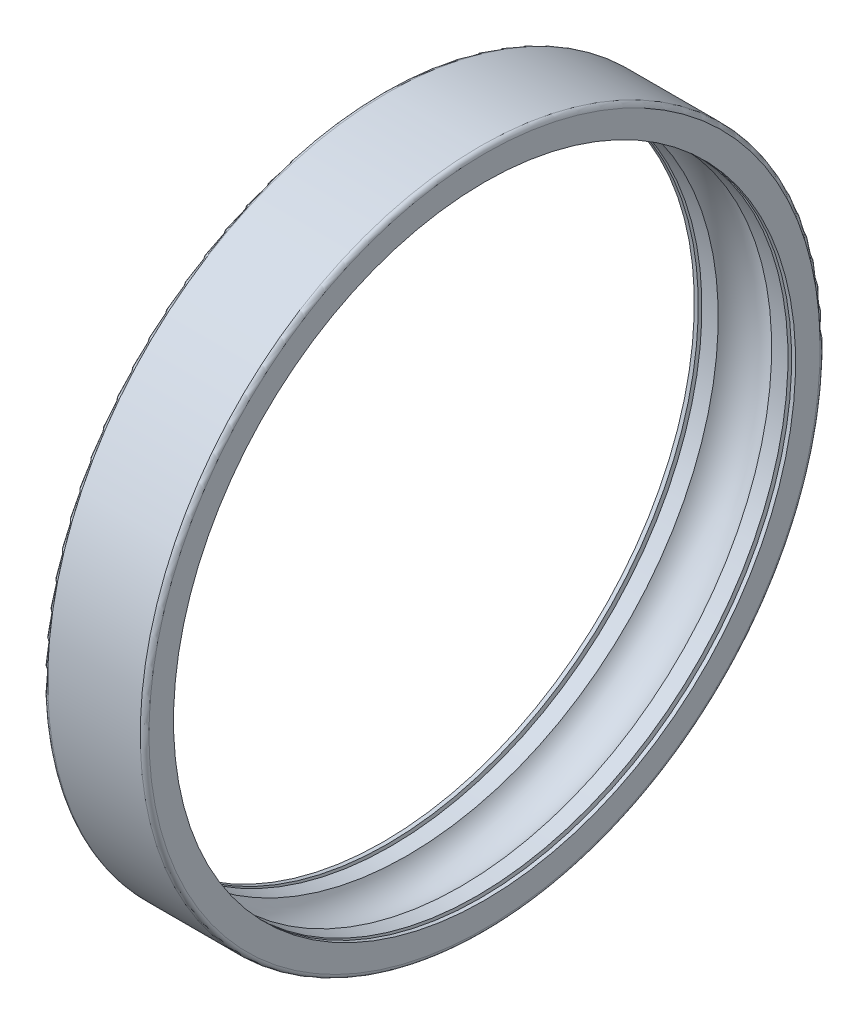
ISO-10303-21;
HEADER;
FILE_DESCRIPTION(('STEP AP214'),'2;1');
FILE_NAME('part.step','',(''),(''),'','','');
FILE_SCHEMA(('AUTOMOTIVE_DESIGN { 1 0 10303 214 1 1 1 1 }'));
ENDSEC;
DATA;
#1=APPLICATION_CONTEXT('core data for automotive mechanical design processes');
#2=APPLICATION_PROTOCOL_DEFINITION('international standard','automotive_design',2000,#1);
#3=PRODUCT_CONTEXT('',#1,'mechanical');
#4=PRODUCT('Part','Part','',(#3));
#5=PRODUCT_RELATED_PRODUCT_CATEGORY('part','',(#4));
#6=PRODUCT_DEFINITION_FORMATION('','',#4);
#7=PRODUCT_DEFINITION_CONTEXT('part definition',#1,'design');
#8=PRODUCT_DEFINITION('design','',#6,#7);
#9=PRODUCT_DEFINITION_SHAPE('','',#8);
#10=(LENGTH_UNIT() NAMED_UNIT(*) SI_UNIT(.MILLI.,.METRE.));
#11=(NAMED_UNIT(*) PLANE_ANGLE_UNIT() SI_UNIT($,.RADIAN.));
#12=(NAMED_UNIT(*) SI_UNIT($,.STERADIAN.) SOLID_ANGLE_UNIT());
#13=UNCERTAINTY_MEASURE_WITH_UNIT(LENGTH_MEASURE(1.E-05),#10,'distance_accuracy_value','');
#14=(GEOMETRIC_REPRESENTATION_CONTEXT(3) GLOBAL_UNCERTAINTY_ASSIGNED_CONTEXT((#13)) GLOBAL_UNIT_ASSIGNED_CONTEXT((#10,
#11,#12)) REPRESENTATION_CONTEXT('',''));
#15=CARTESIAN_POINT('',(0.,0.,0.));
#16=DIRECTION('',(0.,0.,1.));
#17=DIRECTION('',(1.,0.,0.));
#18=AXIS2_PLACEMENT_3D('',#15,#16,#17);
#19=CARTESIAN_POINT('',(2.67330926563097,0.,0.));
#20=DIRECTION('',(-1.,0.,0.));
#21=DIRECTION('',(0.,1.,0.));
#22=AXIS2_PLACEMENT_3D('',#19,#20,#21);
#23=CYLINDRICAL_SURFACE('',#22,21.5);
#24=CARTESIAN_POINT('',(3.5,0.,0.));
#25=DIRECTION('',(1.,0.,0.));
#26=DIRECTION('',(0.,1.,0.));
#27=AXIS2_PLACEMENT_3D('',#24,#25,#26);
#28=CIRCLE('',#27,21.5);
#29=CARTESIAN_POINT('',(3.5,21.5,0.));
#30=VERTEX_POINT('',#29);
#31=EDGE_CURVE('E11',#30,#30,#28,.T.);
#32=ORIENTED_EDGE('',*,*,#31,.T.);
#33=EDGE_LOOP('',(#32));
#34=FACE_BOUND('',#33,.T.);
#35=CARTESIAN_POINT('',(3.225,0.,0.));
#36=DIRECTION('',(-1.,0.,0.));
#37=DIRECTION('',(0.,1.,0.));
#38=AXIS2_PLACEMENT_3D('',#35,#36,#37);
#39=CIRCLE('',#38,21.5);
#40=CARTESIAN_POINT('',(3.225,-21.5,0.));
#41=VERTEX_POINT('',#40);
#42=EDGE_CURVE('E20',#41,#41,#39,.T.);
#43=ORIENTED_EDGE('',*,*,#42,.T.);
#44=EDGE_LOOP('',(#43));
#45=FACE_BOUND('',#44,.T.);
#46=ADVANCED_FACE('F16',(#34,#45),#23,.F.);
#47=CARTESIAN_POINT('',(3.5,22.35,0.));
#48=DIRECTION('',(1.,0.,0.));
#49=DIRECTION('',(0.,1.,0.));
#50=AXIS2_PLACEMENT_3D('',#47,#48,#49);
#51=PLANE('',#50);
#52=CARTESIAN_POINT('',(3.5,0.,0.));
#53=DIRECTION('',(1.,0.,0.));
#54=DIRECTION('',(0.,1.,0.));
#55=AXIS2_PLACEMENT_3D('',#52,#53,#54);
#56=CIRCLE('',#55,23.2);
#57=CARTESIAN_POINT('',(3.5,23.2,0.));
#58=VERTEX_POINT('',#57);
#59=EDGE_CURVE('E26',#58,#58,#56,.T.);
#60=ORIENTED_EDGE('',*,*,#59,.T.);
#61=EDGE_LOOP('',(#60));
#62=FACE_BOUND('',#61,.T.);
#63=ORIENTED_EDGE('',*,*,#31,.F.);
#64=EDGE_LOOP('',(#63));
#65=FACE_BOUND('',#64,.T.);
#66=ADVANCED_FACE('F132',(#62,#65),#51,.T.);
#67=CARTESIAN_POINT('',(3.2,0.,0.));
#68=DIRECTION('',(1.,0.,0.));
#69=DIRECTION('',(0.,0.,-1.));
#70=AXIS2_PLACEMENT_3D('',#67,#68,#69);
#71=TOROIDAL_SURFACE('',#70,23.2,0.3);
#72=CARTESIAN_POINT('',(3.2,0.,0.));
#73=DIRECTION('',(1.,0.,0.));
#74=DIRECTION('',(0.,1.,0.));
#75=AXIS2_PLACEMENT_3D('',#72,#73,#74);
#76=CIRCLE('',#75,23.5);
#77=CARTESIAN_POINT('',(3.2,23.5,0.));
#78=VERTEX_POINT('',#77);
#79=EDGE_CURVE('E89',#78,#78,#76,.T.);
#80=ORIENTED_EDGE('',*,*,#79,.T.);
#81=EDGE_LOOP('',(#80));
#82=FACE_BOUND('',#81,.T.);
#83=ORIENTED_EDGE('',*,*,#59,.F.);
#84=EDGE_LOOP('',(#83));
#85=FACE_BOUND('',#84,.T.);
#86=ADVANCED_FACE('F137',(#82,#85),#71,.T.);
#87=CARTESIAN_POINT('',(0.,0.,0.));
#88=DIRECTION('',(-1.,0.,0.));
#89=DIRECTION('',(0.,1.,0.));
#90=AXIS2_PLACEMENT_3D('',#87,#88,#89);
#91=CYLINDRICAL_SURFACE('',#90,23.5);
#92=CARTESIAN_POINT('',(-3.2,0.,0.));
#93=DIRECTION('',(1.,0.,0.));
#94=DIRECTION('',(0.,1.,0.));
#95=AXIS2_PLACEMENT_3D('',#92,#93,#94);
#96=CIRCLE('',#95,23.5);
#97=CARTESIAN_POINT('',(-3.2,23.5,0.));
#98=VERTEX_POINT('',#97);
#99=EDGE_CURVE('E93',#98,#98,#96,.T.);
#100=ORIENTED_EDGE('',*,*,#99,.T.);
#101=EDGE_LOOP('',(#100));
#102=FACE_BOUND('',#101,.T.);
#103=ORIENTED_EDGE('',*,*,#79,.F.);
#104=EDGE_LOOP('',(#103));
#105=FACE_BOUND('',#104,.T.);
#106=ADVANCED_FACE('F18',(#102,#105),#91,.T.);
#107=CARTESIAN_POINT('',(-3.2,0.,0.));
#108=DIRECTION('',(1.,0.,0.));
#109=DIRECTION('',(0.,0.,-1.));
#110=AXIS2_PLACEMENT_3D('',#107,#108,#109);
#111=TOROIDAL_SURFACE('',#110,23.2,0.3);
#112=CARTESIAN_POINT('',(-3.5,0.,0.));
#113=DIRECTION('',(1.,0.,0.));
#114=DIRECTION('',(0.,1.,0.));
#115=AXIS2_PLACEMENT_3D('',#112,#113,#114);
#116=CIRCLE('',#115,23.2);
#117=CARTESIAN_POINT('',(-3.5,23.2,0.));
#118=VERTEX_POINT('',#117);
#119=EDGE_CURVE('E97',#118,#118,#116,.T.);
#120=ORIENTED_EDGE('',*,*,#119,.T.);
#121=EDGE_LOOP('',(#120));
#122=FACE_BOUND('',#121,.T.);
#123=ORIENTED_EDGE('',*,*,#99,.F.);
#124=EDGE_LOOP('',(#123));
#125=FACE_BOUND('',#124,.T.);
#126=ADVANCED_FACE('F236',(#122,#125),#111,.T.);
#127=CARTESIAN_POINT('',(-3.5,22.35,0.));
#128=DIRECTION('',(-1.,0.,0.));
#129=DIRECTION('',(0.,-1.,0.));
#130=AXIS2_PLACEMENT_3D('',#127,#128,#129);
#131=PLANE('',#130);
#132=CARTESIAN_POINT('',(-3.5,0.,0.));
#133=DIRECTION('',(1.,0.,0.));
#134=DIRECTION('',(0.,1.,0.));
#135=AXIS2_PLACEMENT_3D('',#132,#133,#134);
#136=CIRCLE('',#135,21.5);
#137=CARTESIAN_POINT('',(-3.5,21.5,0.));
#138=VERTEX_POINT('',#137);
#139=EDGE_CURVE('E87',#138,#138,#136,.T.);
#140=ORIENTED_EDGE('',*,*,#139,.T.);
#141=EDGE_LOOP('',(#140));
#142=FACE_BOUND('',#141,.T.);
#143=ORIENTED_EDGE('',*,*,#119,.F.);
#144=EDGE_LOOP('',(#143));
#145=FACE_BOUND('',#144,.T.);
#146=ADVANCED_FACE('F227',(#142,#145),#131,.T.);
#147=CARTESIAN_POINT('',(-2.67330926563097,0.,0.));
#148=DIRECTION('',(-1.,0.,0.));
#149=DIRECTION('',(0.,1.,0.));
#150=AXIS2_PLACEMENT_3D('',#147,#148,#149);
#151=CYLINDRICAL_SURFACE('',#150,21.5);
#152=ORIENTED_EDGE('',*,*,#139,.F.);
#153=EDGE_LOOP('',(#152));
#154=FACE_BOUND('',#153,.T.);
#155=CARTESIAN_POINT('',(-3.225,0.,0.));
#156=DIRECTION('',(1.,0.,0.));
#157=DIRECTION('',(0.,1.,0.));
#158=AXIS2_PLACEMENT_3D('',#155,#156,#157);
#159=CIRCLE('',#158,21.5);
#160=CARTESIAN_POINT('',(-3.225,-21.5,0.));
#161=VERTEX_POINT('',#160);
#162=EDGE_CURVE('E101',#161,#161,#159,.T.);
#163=ORIENTED_EDGE('',*,*,#162,.T.);
#164=EDGE_LOOP('',(#163));
#165=FACE_BOUND('',#164,.T.);
#166=ADVANCED_FACE('F112',(#154,#165),#151,.F.);
#167=CARTESIAN_POINT('',(0.,0.,0.));
#168=DIRECTION('',(1.,0.,0.));
#169=DIRECTION('',(0.,0.,-1.));
#170=AXIS2_PLACEMENT_3D('',#167,#168,#169);
#171=TOROIDAL_SURFACE('',#170,20.5,2.1);
#172=CARTESIAN_POINT('',(1.84661853126194,0.,0.));
#173=DIRECTION('',(1.,0.,0.));
#174=DIRECTION('',(0.,1.,0.));
#175=AXIS2_PLACEMENT_3D('',#172,#173,#174);
#176=CIRCLE('',#175,21.5);
#177=CARTESIAN_POINT('',(1.84661853126194,21.5,0.));
#178=VERTEX_POINT('',#177);
#179=EDGE_CURVE('E102',#178,#178,#176,.T.);
#180=ORIENTED_EDGE('',*,*,#179,.T.);
#181=EDGE_LOOP('',(#180));
#182=FACE_BOUND('',#181,.T.);
#183=CARTESIAN_POINT('',(-1.84661853126194,0.,0.));
#184=DIRECTION('',(1.,0.,0.));
#185=DIRECTION('',(0.,1.,0.));
#186=AXIS2_PLACEMENT_3D('',#183,#184,#185);
#187=CIRCLE('',#186,21.5);
#188=CARTESIAN_POINT('',(-1.84661853126194,21.5,0.));
#189=VERTEX_POINT('',#188);
#190=EDGE_CURVE('E85',#189,#189,#187,.T.);
#191=ORIENTED_EDGE('',*,*,#190,.F.);
#192=EDGE_LOOP('',(#191));
#193=FACE_BOUND('',#192,.T.);
#194=ADVANCED_FACE('F210',(#182,#193),#171,.F.);
#195=CARTESIAN_POINT('',(-2.67330926563097,0.,0.));
#196=DIRECTION('',(-1.,0.,0.));
#197=DIRECTION('',(0.,1.,0.));
#198=AXIS2_PLACEMENT_3D('',#195,#196,#197);
#199=CYLINDRICAL_SURFACE('',#198,21.5);
#200=ORIENTED_EDGE('',*,*,#190,.T.);
#201=EDGE_LOOP('',(#200));
#202=FACE_BOUND('',#201,.T.);
#203=CARTESIAN_POINT('',(-2.975,0.,0.));
#204=DIRECTION('',(-1.,0.,0.));
#205=DIRECTION('',(0.,1.,0.));
#206=AXIS2_PLACEMENT_3D('',#203,#204,#205);
#207=CIRCLE('',#206,21.5);
#208=CARTESIAN_POINT('',(-2.975,-21.5,0.));
#209=VERTEX_POINT('',#208);
#210=EDGE_CURVE('E88',#209,#209,#207,.T.);
#211=ORIENTED_EDGE('',*,*,#210,.T.);
#212=EDGE_LOOP('',(#211));
#213=FACE_BOUND('',#212,.T.);
#214=ADVANCED_FACE('F201',(#202,#213),#199,.F.);
#215=CARTESIAN_POINT('',(-2.975,20.5,0.));
#216=DIRECTION('',(1.,0.,0.));
#217=DIRECTION('',(0.,1.,0.));
#218=AXIS2_PLACEMENT_3D('',#215,#216,#217);
#219=PLANE('',#218);
#220=CARTESIAN_POINT('',(-2.975,0.,0.));
#221=DIRECTION('',(1.,0.,0.));
#222=DIRECTION('',(0.,1.,0.));
#223=AXIS2_PLACEMENT_3D('',#220,#221,#222);
#224=CIRCLE('',#223,22.5);
#225=CARTESIAN_POINT('',(-2.975,22.5,0.));
#226=VERTEX_POINT('',#225);
#227=EDGE_CURVE('E83',#226,#226,#224,.T.);
#228=ORIENTED_EDGE('',*,*,#227,.F.);
#229=EDGE_LOOP('',(#228));
#230=FACE_BOUND('',#229,.T.);
#231=ORIENTED_EDGE('',*,*,#210,.F.);
#232=EDGE_LOOP('',(#231));
#233=FACE_BOUND('',#232,.T.);
#234=ADVANCED_FACE('F126',(#230,#233),#219,.F.);
#235=CARTESIAN_POINT('',(-3.1,0.,0.));
#236=DIRECTION('',(-1.,0.,0.));
#237=DIRECTION('',(0.,1.,0.));
#238=AXIS2_PLACEMENT_3D('',#235,#236,#237);
#239=CYLINDRICAL_SURFACE('',#238,22.5);
#240=CARTESIAN_POINT('',(-3.225,0.,0.));
#241=DIRECTION('',(1.,0.,0.));
#242=DIRECTION('',(0.,1.,0.));
#243=AXIS2_PLACEMENT_3D('',#240,#241,#242);
#244=CIRCLE('',#243,22.5);
#245=CARTESIAN_POINT('',(-3.225,22.5,0.));
#246=VERTEX_POINT('',#245);
#247=EDGE_CURVE('E107',#246,#246,#244,.T.);
#248=ORIENTED_EDGE('',*,*,#247,.F.);
#249=EDGE_LOOP('',(#248));
#250=FACE_BOUND('',#249,.T.);
#251=ORIENTED_EDGE('',*,*,#227,.T.);
#252=EDGE_LOOP('',(#251));
#253=FACE_BOUND('',#252,.T.);
#254=ADVANCED_FACE('F117',(#250,#253),#239,.F.);
#255=CARTESIAN_POINT('',(-3.225,20.5,0.));
#256=DIRECTION('',(-1.,0.,0.));
#257=DIRECTION('',(0.,-1.,0.));
#258=AXIS2_PLACEMENT_3D('',#255,#256,#257);
#259=PLANE('',#258);
#260=ORIENTED_EDGE('',*,*,#247,.T.);
#261=EDGE_LOOP('',(#260));
#262=FACE_BOUND('',#261,.T.);
#263=ORIENTED_EDGE('',*,*,#162,.F.);
#264=EDGE_LOOP('',(#263));
#265=FACE_BOUND('',#264,.T.);
#266=ADVANCED_FACE('F114',(#262,#265),#259,.F.);
#267=CARTESIAN_POINT('',(2.67330926563097,0.,0.));
#268=DIRECTION('',(-1.,0.,0.));
#269=DIRECTION('',(0.,1.,0.));
#270=AXIS2_PLACEMENT_3D('',#267,#268,#269);
#271=CYLINDRICAL_SURFACE('',#270,21.5);
#272=ORIENTED_EDGE('',*,*,#179,.F.);
#273=EDGE_LOOP('',(#272));
#274=FACE_BOUND('',#273,.T.);
#275=CARTESIAN_POINT('',(2.975,0.,0.));
#276=DIRECTION('',(1.,0.,0.));
#277=DIRECTION('',(0.,1.,0.));
#278=AXIS2_PLACEMENT_3D('',#275,#276,#277);
#279=CIRCLE('',#278,21.5);
#280=CARTESIAN_POINT('',(2.975,-21.5,0.));
#281=VERTEX_POINT('',#280);
#282=EDGE_CURVE('E79',#281,#281,#279,.T.);
#283=ORIENTED_EDGE('',*,*,#282,.T.);
#284=EDGE_LOOP('',(#283));
#285=FACE_BOUND('',#284,.T.);
#286=ADVANCED_FACE('F116',(#274,#285),#271,.F.);
#287=CARTESIAN_POINT('',(2.975,20.5,0.));
#288=DIRECTION('',(-1.,0.,0.));
#289=DIRECTION('',(0.,1.,0.));
#290=AXIS2_PLACEMENT_3D('',#287,#288,#289);
#291=PLANE('',#290);
#292=CARTESIAN_POINT('',(2.975,0.,0.));
#293=DIRECTION('',(-1.,0.,0.));
#294=DIRECTION('',(0.,1.,0.));
#295=AXIS2_PLACEMENT_3D('',#292,#293,#294);
#296=CIRCLE('',#295,22.5);
#297=CARTESIAN_POINT('',(2.975,22.5,0.));
#298=VERTEX_POINT('',#297);
#299=EDGE_CURVE('E75',#298,#298,#296,.T.);
#300=ORIENTED_EDGE('',*,*,#299,.F.);
#301=EDGE_LOOP('',(#300));
#302=FACE_BOUND('',#301,.T.);
#303=ORIENTED_EDGE('',*,*,#282,.F.);
#304=EDGE_LOOP('',(#303));
#305=FACE_BOUND('',#304,.T.);
#306=ADVANCED_FACE('F124',(#302,#305),#291,.F.);
#307=CARTESIAN_POINT('',(3.1,0.,0.));
#308=DIRECTION('',(1.,0.,0.));
#309=DIRECTION('',(0.,1.,0.));
#310=AXIS2_PLACEMENT_3D('',#307,#308,#309);
#311=CYLINDRICAL_SURFACE('',#310,22.5);
#312=CARTESIAN_POINT('',(3.225,0.,0.));
#313=DIRECTION('',(-1.,0.,0.));
#314=DIRECTION('',(0.,1.,0.));
#315=AXIS2_PLACEMENT_3D('',#312,#313,#314);
#316=CIRCLE('',#315,22.5);
#317=CARTESIAN_POINT('',(3.225,22.5,0.));
#318=VERTEX_POINT('',#317);
#319=EDGE_CURVE('E74',#318,#318,#316,.T.);
#320=ORIENTED_EDGE('',*,*,#319,.F.);
#321=EDGE_LOOP('',(#320));
#322=FACE_BOUND('',#321,.T.);
#323=ORIENTED_EDGE('',*,*,#299,.T.);
#324=EDGE_LOOP('',(#323));
#325=FACE_BOUND('',#324,.T.);
#326=ADVANCED_FACE('F141',(#322,#325),#311,.F.);
#327=CARTESIAN_POINT('',(3.225,20.5,0.));
#328=DIRECTION('',(1.,0.,0.));
#329=DIRECTION('',(0.,-1.,0.));
#330=AXIS2_PLACEMENT_3D('',#327,#328,#329);
#331=PLANE('',#330);
#332=ORIENTED_EDGE('',*,*,#319,.T.);
#333=EDGE_LOOP('',(#332));
#334=FACE_BOUND('',#333,.T.);
#335=ORIENTED_EDGE('',*,*,#42,.F.);
#336=EDGE_LOOP('',(#335));
#337=FACE_BOUND('',#336,.T.);
#338=ADVANCED_FACE('F145',(#334,#337),#331,.F.);
#339=CLOSED_SHELL('',(#46,#66,#86,#106,#126,#146,#166,#194,#214,#234,#254,#266,#286,#306,#326,#338));
#340=MANIFOLD_SOLID_BREP('B1',#339);
#341=ADVANCED_BREP_SHAPE_REPRESENTATION('',(#18,#340),#14);
#342=SHAPE_DEFINITION_REPRESENTATION(#9,#341);
ENDSEC;
END-ISO-10303-21;
